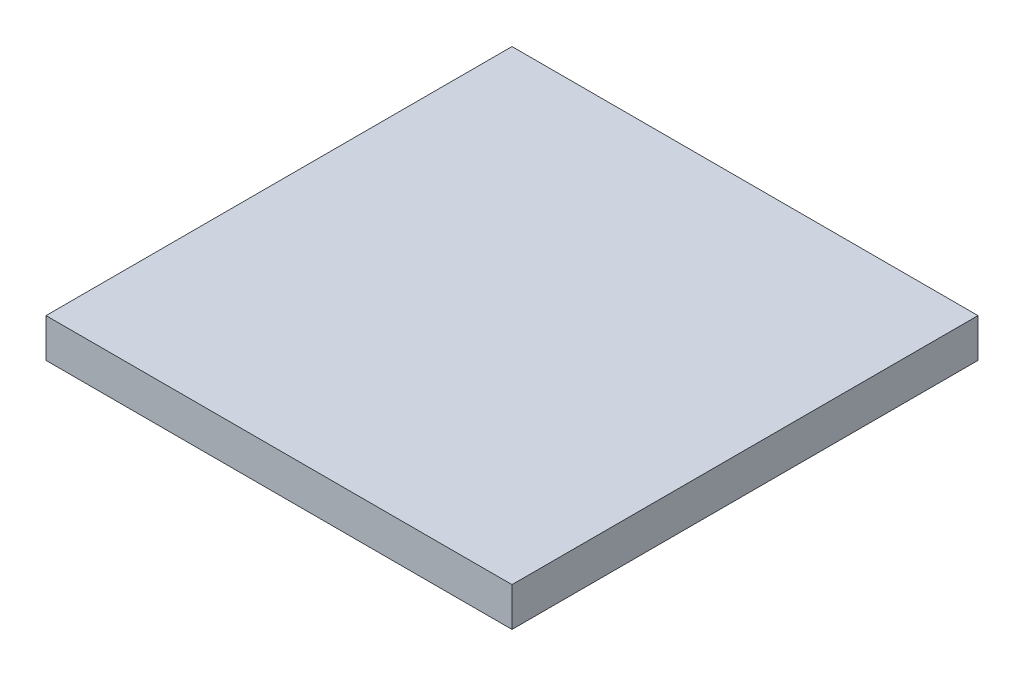
ISO-10303-21;
HEADER;
FILE_DESCRIPTION(('STEP AP214'),'2;1');
FILE_NAME('part.step','',(''),(''),'','','');
FILE_SCHEMA(('AUTOMOTIVE_DESIGN { 1 0 10303 214 1 1 1 1 }'));
ENDSEC;
DATA;
#1=APPLICATION_CONTEXT('core data for automotive mechanical design processes');
#2=APPLICATION_PROTOCOL_DEFINITION('international standard','automotive_design',2000,#1);
#3=PRODUCT_CONTEXT('',#1,'mechanical');
#4=PRODUCT('Part','Part','',(#3));
#5=PRODUCT_RELATED_PRODUCT_CATEGORY('part','',(#4));
#6=PRODUCT_DEFINITION_FORMATION('','',#4);
#7=PRODUCT_DEFINITION_CONTEXT('part definition',#1,'design');
#8=PRODUCT_DEFINITION('design','',#6,#7);
#9=PRODUCT_DEFINITION_SHAPE('','',#8);
#10=(LENGTH_UNIT() NAMED_UNIT(*) SI_UNIT(.MILLI.,.METRE.));
#11=(NAMED_UNIT(*) PLANE_ANGLE_UNIT() SI_UNIT($,.RADIAN.));
#12=(NAMED_UNIT(*) SI_UNIT($,.STERADIAN.) SOLID_ANGLE_UNIT());
#13=UNCERTAINTY_MEASURE_WITH_UNIT(LENGTH_MEASURE(1.E-05),#10,'distance_accuracy_value','');
#14=(GEOMETRIC_REPRESENTATION_CONTEXT(3) GLOBAL_UNCERTAINTY_ASSIGNED_CONTEXT((#13)) GLOBAL_UNIT_ASSIGNED_CONTEXT((#10,
#11,#12)) REPRESENTATION_CONTEXT('',''));
#15=CARTESIAN_POINT('',(0.,0.,0.));
#16=DIRECTION('',(0.,0.,1.));
#17=DIRECTION('',(1.,0.,0.));
#18=AXIS2_PLACEMENT_3D('',#15,#16,#17);
#19=CARTESIAN_POINT('',(0.,0.,0.));
#20=DIRECTION('',(0.,1.,0.));
#21=DIRECTION('',(0.,0.,1.));
#22=AXIS2_PLACEMENT_3D('',#19,#20,#21);
#23=PLANE('',#22);
#24=DIRECTION('',(-1.,0.,0.));
#25=VECTOR('',#24,1.);
#26=CARTESIAN_POINT('',(6.,0.,-6.));
#27=LINE('',#26,#25);
#28=CARTESIAN_POINT('',(6.,0.,-6.));
#29=VERTEX_POINT('',#28);
#30=CARTESIAN_POINT('',(-6.,0.,-6.));
#31=VERTEX_POINT('',#30);
#32=EDGE_CURVE('E19',#29,#31,#27,.T.);
#33=ORIENTED_EDGE('',*,*,#32,.F.);
#34=DIRECTION('',(0.,0.,-1.));
#35=VECTOR('',#34,1.);
#36=CARTESIAN_POINT('',(6.,0.,6.));
#37=LINE('',#36,#35);
#38=CARTESIAN_POINT('',(6.,0.,6.));
#39=VERTEX_POINT('',#38);
#40=EDGE_CURVE('E79',#39,#29,#37,.T.);
#41=ORIENTED_EDGE('',*,*,#40,.F.);
#42=DIRECTION('',(1.,0.,0.));
#43=VECTOR('',#42,1.);
#44=CARTESIAN_POINT('',(-6.,0.,6.));
#45=LINE('',#44,#43);
#46=CARTESIAN_POINT('',(-6.,0.,6.));
#47=VERTEX_POINT('',#46);
#48=EDGE_CURVE('E67',#47,#39,#45,.T.);
#49=ORIENTED_EDGE('',*,*,#48,.F.);
#50=DIRECTION('',(0.,0.,1.));
#51=VECTOR('',#50,1.);
#52=CARTESIAN_POINT('',(-6.,0.,-6.));
#53=LINE('',#52,#51);
#54=EDGE_CURVE('E54',#31,#47,#53,.T.);
#55=ORIENTED_EDGE('',*,*,#54,.F.);
#56=EDGE_LOOP('',(#33,#41,#49,#55));
#57=FACE_BOUND('',#56,.T.);
#58=ADVANCED_FACE('F16',(#57),#23,.F.);
#59=CARTESIAN_POINT('',(6.,0.,-6.));
#60=DIRECTION('',(0.,0.,-1.));
#61=DIRECTION('',(-1.,0.,0.));
#62=AXIS2_PLACEMENT_3D('',#59,#60,#61);
#63=PLANE('',#62);
#64=ORIENTED_EDGE('',*,*,#32,.T.);
#65=DIRECTION('',(0.,1.,0.));
#66=VECTOR('',#65,1.);
#67=CARTESIAN_POINT('',(-6.,0.,-6.));
#68=LINE('',#67,#66);
#69=CARTESIAN_POINT('',(-6.,1.,-6.));
#70=VERTEX_POINT('',#69);
#71=EDGE_CURVE('E60',#70,#31,#68,.F.);
#72=ORIENTED_EDGE('',*,*,#71,.F.);
#73=DIRECTION('',(1.,0.,0.));
#74=VECTOR('',#73,1.);
#75=CARTESIAN_POINT('',(0.,1.,-6.));
#76=LINE('',#75,#74);
#77=CARTESIAN_POINT('',(6.,1.,-6.));
#78=VERTEX_POINT('',#77);
#79=EDGE_CURVE('E82',#78,#70,#76,.F.);
#80=ORIENTED_EDGE('',*,*,#79,.F.);
#81=DIRECTION('',(0.,1.,0.));
#82=VECTOR('',#81,1.);
#83=CARTESIAN_POINT('',(6.,0.,-6.));
#84=LINE('',#83,#82);
#85=EDGE_CURVE('E63',#29,#78,#84,.T.);
#86=ORIENTED_EDGE('',*,*,#85,.F.);
#87=EDGE_LOOP('',(#64,#72,#80,#86));
#88=FACE_BOUND('',#87,.T.);
#89=ADVANCED_FACE('F59',(#88),#63,.T.);
#90=CARTESIAN_POINT('',(-6.,0.,-6.));
#91=DIRECTION('',(-1.,0.,0.));
#92=DIRECTION('',(0.,0.,1.));
#93=AXIS2_PLACEMENT_3D('',#90,#91,#92);
#94=PLANE('',#93);
#95=ORIENTED_EDGE('',*,*,#54,.T.);
#96=DIRECTION('',(0.,1.,0.));
#97=VECTOR('',#96,1.);
#98=CARTESIAN_POINT('',(-6.,0.,6.));
#99=LINE('',#98,#97);
#100=CARTESIAN_POINT('',(-6.,1.,6.));
#101=VERTEX_POINT('',#100);
#102=EDGE_CURVE('E69',#101,#47,#99,.F.);
#103=ORIENTED_EDGE('',*,*,#102,.F.);
#104=DIRECTION('',(0.,0.,1.));
#105=VECTOR('',#104,1.);
#106=CARTESIAN_POINT('',(-6.,1.,0.));
#107=LINE('',#106,#105);
#108=EDGE_CURVE('E73',#70,#101,#107,.T.);
#109=ORIENTED_EDGE('',*,*,#108,.F.);
#110=ORIENTED_EDGE('',*,*,#71,.T.);
#111=EDGE_LOOP('',(#95,#103,#109,#110));
#112=FACE_BOUND('',#111,.T.);
#113=ADVANCED_FACE('F71',(#112),#94,.T.);
#114=CARTESIAN_POINT('',(-6.,0.,6.));
#115=DIRECTION('',(0.,0.,1.));
#116=DIRECTION('',(1.,0.,0.));
#117=AXIS2_PLACEMENT_3D('',#114,#115,#116);
#118=PLANE('',#117);
#119=ORIENTED_EDGE('',*,*,#48,.T.);
#120=DIRECTION('',(0.,1.,0.));
#121=VECTOR('',#120,1.);
#122=CARTESIAN_POINT('',(6.,0.,6.));
#123=LINE('',#122,#121);
#124=CARTESIAN_POINT('',(6.,1.,6.));
#125=VERTEX_POINT('',#124);
#126=EDGE_CURVE('E34',#125,#39,#123,.F.);
#127=ORIENTED_EDGE('',*,*,#126,.F.);
#128=DIRECTION('',(1.,0.,0.));
#129=VECTOR('',#128,1.);
#130=CARTESIAN_POINT('',(0.,1.,6.));
#131=LINE('',#130,#129);
#132=EDGE_CURVE('E25',#101,#125,#131,.T.);
#133=ORIENTED_EDGE('',*,*,#132,.F.);
#134=ORIENTED_EDGE('',*,*,#102,.T.);
#135=EDGE_LOOP('',(#119,#127,#133,#134));
#136=FACE_BOUND('',#135,.T.);
#137=ADVANCED_FACE('F88',(#136),#118,.T.);
#138=CARTESIAN_POINT('',(6.,0.,6.));
#139=DIRECTION('',(1.,0.,0.));
#140=DIRECTION('',(0.,0.,-1.));
#141=AXIS2_PLACEMENT_3D('',#138,#139,#140);
#142=PLANE('',#141);
#143=ORIENTED_EDGE('',*,*,#40,.T.);
#144=ORIENTED_EDGE('',*,*,#85,.T.);
#145=DIRECTION('',(0.,0.,1.));
#146=VECTOR('',#145,1.);
#147=CARTESIAN_POINT('',(6.,1.,0.));
#148=LINE('',#147,#146);
#149=EDGE_CURVE('E11',#125,#78,#148,.F.);
#150=ORIENTED_EDGE('',*,*,#149,.F.);
#151=ORIENTED_EDGE('',*,*,#126,.T.);
#152=EDGE_LOOP('',(#143,#144,#150,#151));
#153=FACE_BOUND('',#152,.T.);
#154=ADVANCED_FACE('F90',(#153),#142,.T.);
#155=CARTESIAN_POINT('',(0.,1.,0.));
#156=DIRECTION('',(0.,1.,0.));
#157=DIRECTION('',(0.,0.,1.));
#158=AXIS2_PLACEMENT_3D('',#155,#156,#157);
#159=PLANE('',#158);
#160=ORIENTED_EDGE('',*,*,#132,.T.);
#161=ORIENTED_EDGE('',*,*,#149,.T.);
#162=ORIENTED_EDGE('',*,*,#79,.T.);
#163=ORIENTED_EDGE('',*,*,#108,.T.);
#164=EDGE_LOOP('',(#160,#161,#162,#163));
#165=FACE_BOUND('',#164,.T.);
#166=ADVANCED_FACE('F87',(#165),#159,.T.);
#167=CLOSED_SHELL('',(#58,#89,#113,#137,#154,#166));
#168=MANIFOLD_SOLID_BREP('B1',#167);
#169=ADVANCED_BREP_SHAPE_REPRESENTATION('',(#18,#168),#14);
#170=SHAPE_DEFINITION_REPRESENTATION(#9,#169);
ENDSEC;
END-ISO-10303-21;
